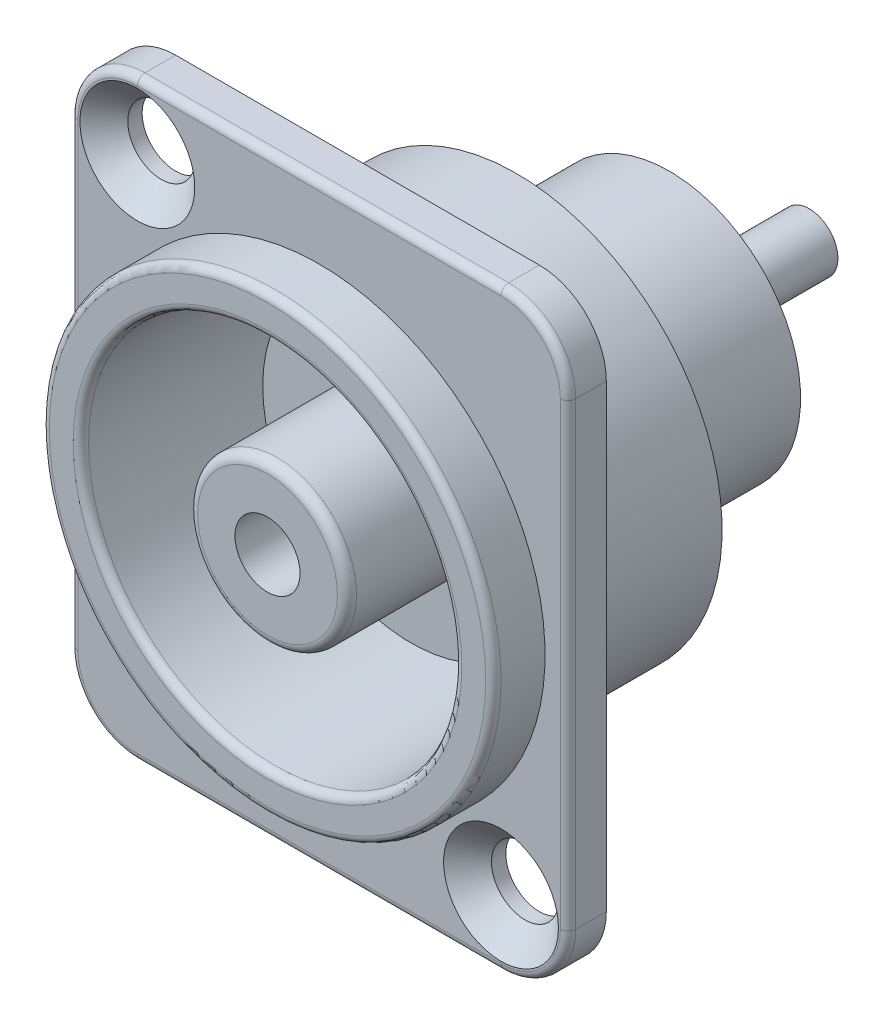
ISO-10303-21;
HEADER;
FILE_DESCRIPTION(('STEP AP214'),'2;1');
FILE_NAME('part.step','',(''),(''),'','','');
FILE_SCHEMA(('AUTOMOTIVE_DESIGN { 1 0 10303 214 1 1 1 1 }'));
ENDSEC;
DATA;
#1=APPLICATION_CONTEXT('core data for automotive mechanical design processes');
#2=APPLICATION_PROTOCOL_DEFINITION('international standard','automotive_design',2000,#1);
#3=PRODUCT_CONTEXT('',#1,'mechanical');
#4=PRODUCT('Part','Part','',(#3));
#5=PRODUCT_RELATED_PRODUCT_CATEGORY('part','',(#4));
#6=PRODUCT_DEFINITION_FORMATION('','',#4);
#7=PRODUCT_DEFINITION_CONTEXT('part definition',#1,'design');
#8=PRODUCT_DEFINITION('design','',#6,#7);
#9=PRODUCT_DEFINITION_SHAPE('','',#8);
#10=(LENGTH_UNIT() NAMED_UNIT(*) SI_UNIT(.MILLI.,.METRE.));
#11=(NAMED_UNIT(*) PLANE_ANGLE_UNIT() SI_UNIT($,.RADIAN.));
#12=(NAMED_UNIT(*) SI_UNIT($,.STERADIAN.) SOLID_ANGLE_UNIT());
#13=UNCERTAINTY_MEASURE_WITH_UNIT(LENGTH_MEASURE(1.E-05),#10,'distance_accuracy_value','');
#14=(GEOMETRIC_REPRESENTATION_CONTEXT(3) GLOBAL_UNCERTAINTY_ASSIGNED_CONTEXT((#13)) GLOBAL_UNIT_ASSIGNED_CONTEXT((#10,
#11,#12)) REPRESENTATION_CONTEXT('',''));
#15=CARTESIAN_POINT('',(0.,0.,0.));
#16=DIRECTION('',(0.,0.,1.));
#17=DIRECTION('',(1.,0.,0.));
#18=AXIS2_PLACEMENT_3D('',#15,#16,#17);
#19=CARTESIAN_POINT('',(0.,0.,2.));
#20=DIRECTION('',(0.,0.,-1.));
#21=DIRECTION('',(-1.,0.,0.));
#22=AXIS2_PLACEMENT_3D('',#19,#20,#21);
#23=PLANE('',#22);
#24=CARTESIAN_POINT('',(9.5,-12.,2.));
#25=DIRECTION('',(0.,0.,1.));
#26=DIRECTION('',(1.,0.,0.));
#27=AXIS2_PLACEMENT_3D('',#24,#25,#26);
#28=CIRCLE('',#27,2.99997515496501);
#29=CARTESIAN_POINT('',(12.499975154965,-12.,2.));
#30=VERTEX_POINT('',#29);
#31=EDGE_CURVE('E870',#30,#30,#28,.T.);
#32=ORIENTED_EDGE('',*,*,#31,.F.);
#33=EDGE_LOOP('',(#32));
#34=FACE_BOUND('',#33,.T.);
#35=CARTESIAN_POINT('',(0.,0.,2.));
#36=DIRECTION('',(0.,0.,-1.));
#37=DIRECTION('',(-1.,0.,0.));
#38=AXIS2_PLACEMENT_3D('',#35,#36,#37);
#39=CIRCLE('',#38,11.8);
#40=CARTESIAN_POINT('',(-11.8,0.,2.));
#41=VERTEX_POINT('',#40);
#42=EDGE_CURVE('E211',#41,#41,#39,.F.);
#43=ORIENTED_EDGE('',*,*,#42,.F.);
#44=EDGE_LOOP('',(#43));
#45=FACE_BOUND('',#44,.T.);
#46=CARTESIAN_POINT('',(9.5,12.,1.99999999999971));
#47=DIRECTION('',(0.,0.,-1.));
#48=DIRECTION('',(0.,1.,0.));
#49=AXIS2_PLACEMENT_3D('',#46,#47,#48);
#50=CIRCLE('',#49,3.09999951881);
#51=CARTESIAN_POINT('',(9.5,15.099999759405,1.99999999999993));
#52=VERTEX_POINT('',#51);
#53=CARTESIAN_POINT('',(12.599999903762,12.,1.99999999999994));
#54=VERTEX_POINT('',#53);
#55=EDGE_CURVE('E156',#52,#54,#50,.T.);
#56=ORIENTED_EDGE('',*,*,#55,.F.);
#57=DIRECTION('',(-1.,0.,0.));
#58=VECTOR('',#57,1.);
#59=CARTESIAN_POINT('',(0.,15.1,2.));
#60=LINE('',#59,#58);
#61=CARTESIAN_POINT('',(-9.5,15.099999903762,1.99999999999994));
#62=VERTEX_POINT('',#61);
#63=EDGE_CURVE('E199',#62,#52,#60,.F.);
#64=ORIENTED_EDGE('',*,*,#63,.F.);
#65=CARTESIAN_POINT('',(-9.5,12.,1.99999999999971));
#66=DIRECTION('',(0.,0.,-1.));
#67=DIRECTION('',(-1.,0.,0.));
#68=AXIS2_PLACEMENT_3D('',#65,#66,#67);
#69=CIRCLE('',#68,3.09999951881);
#70=CARTESIAN_POINT('',(-12.5999996992563,12.,1.99999999999991));
#71=VERTEX_POINT('',#70);
#72=EDGE_CURVE('E596',#71,#62,#69,.T.);
#73=ORIENTED_EDGE('',*,*,#72,.F.);
#74=DIRECTION('',(0.,-1.,0.));
#75=VECTOR('',#74,1.);
#76=CARTESIAN_POINT('',(-12.6,12.07591990335,2.));
#77=LINE('',#76,#75);
#78=CARTESIAN_POINT('',(-12.5999998797025,-11.99999999993,1.99999999999993));
#79=VERTEX_POINT('',#78);
#80=EDGE_CURVE('E601',#79,#71,#77,.F.);
#81=ORIENTED_EDGE('',*,*,#80,.F.);
#82=CARTESIAN_POINT('',(-9.5,-12.,1.99999999999971));
#83=DIRECTION('',(0.,0.,-1.));
#84=DIRECTION('',(0.,-1.,0.));
#85=AXIS2_PLACEMENT_3D('',#82,#83,#84);
#86=CIRCLE('',#85,3.09999951881);
#87=CARTESIAN_POINT('',(-9.5,-15.0999995789587,1.99999999999984));
#88=VERTEX_POINT('',#87);
#89=EDGE_CURVE('E637',#88,#79,#86,.T.);
#90=ORIENTED_EDGE('',*,*,#89,.F.);
#91=DIRECTION('',(1.,0.,0.));
#92=VECTOR('',#91,1.);
#93=CARTESIAN_POINT('',(-9.57591990335,-15.09999951881,1.99999999999971));
#94=LINE('',#93,#92);
#95=CARTESIAN_POINT('',(9.5,-15.09999951881,1.99999999999978));
#96=VERTEX_POINT('',#95);
#97=EDGE_CURVE('E661',#96,#88,#94,.F.);
#98=ORIENTED_EDGE('',*,*,#97,.F.);
#99=CARTESIAN_POINT('',(9.5,-12.,1.99999999999971));
#100=DIRECTION('',(0.,0.,-1.));
#101=DIRECTION('',(1.,0.,0.));
#102=AXIS2_PLACEMENT_3D('',#99,#100,#101);
#103=CIRCLE('',#102,3.09999951881);
#104=CARTESIAN_POINT('',(12.599999807524,-12.,1.99999999999994));
#105=VERTEX_POINT('',#104);
#106=EDGE_CURVE('E210',#105,#96,#103,.T.);
#107=ORIENTED_EDGE('',*,*,#106,.F.);
#108=DIRECTION('',(0.,1.,0.));
#109=VECTOR('',#108,1.);
#110=CARTESIAN_POINT('',(12.6,0.,2.));
#111=LINE('',#110,#109);
#112=EDGE_CURVE('E163',#54,#105,#111,.F.);
#113=ORIENTED_EDGE('',*,*,#112,.F.);
#114=EDGE_LOOP('',(#56,#64,#73,#81,#90,#98,#107,#113));
#115=FACE_BOUND('',#114,.T.);
#116=CARTESIAN_POINT('',(-9.5,12.,2.));
#117=DIRECTION('',(0.,0.,1.));
#118=DIRECTION('',(1.,0.,0.));
#119=AXIS2_PLACEMENT_3D('',#116,#117,#118);
#120=CIRCLE('',#119,2.99997515496501);
#121=CARTESIAN_POINT('',(-6.50002484503499,12.,2.));
#122=VERTEX_POINT('',#121);
#123=EDGE_CURVE('E866',#122,#122,#120,.T.);
#124=ORIENTED_EDGE('',*,*,#123,.F.);
#125=EDGE_LOOP('',(#124));
#126=FACE_BOUND('',#125,.T.);
#127=ADVANCED_FACE('F37',(#34,#45,#115,#126),#23,.F.);
#128=CARTESIAN_POINT('',(0.,0.,0.));
#129=DIRECTION('',(0.,0.,-1.));
#130=DIRECTION('',(-1.,0.,0.));
#131=AXIS2_PLACEMENT_3D('',#128,#129,#130);
#132=PLANE('',#131);
#133=CARTESIAN_POINT('',(0.,0.,0.));
#134=DIRECTION('',(0.,0.,-1.));
#135=DIRECTION('',(-1.,0.,0.));
#136=AXIS2_PLACEMENT_3D('',#133,#134,#135);
#137=CIRCLE('',#136,1.7);
#138=CARTESIAN_POINT('',(-1.7,0.,0.));
#139=VERTEX_POINT('',#138);
#140=EDGE_CURVE('E275',#139,#139,#137,.F.);
#141=ORIENTED_EDGE('',*,*,#140,.T.);
#142=EDGE_LOOP('',(#141));
#143=FACE_BOUND('',#142,.T.);
#144=ADVANCED_FACE('F39',(#143),#132,.F.);
#145=CARTESIAN_POINT('',(0.,0.,6.115));
#146=DIRECTION('',(0.,0.,-1.));
#147=DIRECTION('',(-1.,0.,0.));
#148=AXIS2_PLACEMENT_3D('',#145,#146,#147);
#149=CYLINDRICAL_SURFACE('',#148,1.7);
#150=ORIENTED_EDGE('',*,*,#140,.F.);
#151=EDGE_LOOP('',(#150));
#152=FACE_BOUND('',#151,.T.);
#153=CARTESIAN_POINT('',(0.,0.,4.7));
#154=DIRECTION('',(0.,0.,-1.));
#155=DIRECTION('',(-1.,0.,0.));
#156=AXIS2_PLACEMENT_3D('',#153,#154,#155);
#157=CIRCLE('',#156,1.7);
#158=CARTESIAN_POINT('',(-1.7,0.,4.7));
#159=VERTEX_POINT('',#158);
#160=EDGE_CURVE('E270',#159,#159,#157,.F.);
#161=ORIENTED_EDGE('',*,*,#160,.T.);
#162=EDGE_LOOP('',(#161));
#163=FACE_BOUND('',#162,.T.);
#164=ADVANCED_FACE('F495',(#152,#163),#149,.F.);
#165=CARTESIAN_POINT('',(0.,0.,4.7));
#166=DIRECTION('',(0.,0.,-1.));
#167=DIRECTION('',(-1.,0.,0.));
#168=AXIS2_PLACEMENT_3D('',#165,#166,#167);
#169=PLANE('',#168);
#170=ORIENTED_EDGE('',*,*,#160,.F.);
#171=EDGE_LOOP('',(#170));
#172=FACE_BOUND('',#171,.T.);
#173=CARTESIAN_POINT('',(0.,0.,4.7));
#174=DIRECTION('',(0.,0.,-1.));
#175=DIRECTION('',(0.,1.,0.));
#176=AXIS2_PLACEMENT_3D('',#173,#174,#175);
#177=CIRCLE('',#176,3.64999999999999);
#178=CARTESIAN_POINT('',(0.,3.65000000000001,4.7));
#179=VERTEX_POINT('',#178);
#180=CARTESIAN_POINT('',(0.,-3.64999999999999,4.7));
#181=VERTEX_POINT('',#180);
#182=EDGE_CURVE('E420',#179,#181,#177,.T.);
#183=ORIENTED_EDGE('',*,*,#182,.F.);
#184=CARTESIAN_POINT('',(0.,0.,4.7));
#185=DIRECTION('',(0.,0.,-1.));
#186=DIRECTION('',(0.,-1.,0.));
#187=AXIS2_PLACEMENT_3D('',#184,#185,#186);
#188=CIRCLE('',#187,3.65000000000001);
#189=EDGE_CURVE('E274',#181,#179,#188,.T.);
#190=ORIENTED_EDGE('',*,*,#189,.F.);
#191=EDGE_LOOP('',(#183,#190));
#192=FACE_BOUND('',#191,.T.);
#193=ADVANCED_FACE('F410',(#172,#192),#169,.F.);
#194=CARTESIAN_POINT('',(0.,0.,4.2));
#195=DIRECTION('',(0.,0.,-1.));
#196=DIRECTION('',(0.,1.,0.));
#197=AXIS2_PLACEMENT_3D('',#194,#195,#196);
#198=TOROIDAL_SURFACE('',#197,3.65,0.5);
#199=ORIENTED_EDGE('',*,*,#189,.T.);
#200=ORIENTED_EDGE('',*,*,#182,.T.);
#201=EDGE_LOOP('',(#199,#200));
#202=FACE_BOUND('',#201,.T.);
#203=CARTESIAN_POINT('',(0.,0.,4.2));
#204=DIRECTION('',(0.,0.,-1.));
#205=DIRECTION('',(-1.,0.,0.));
#206=AXIS2_PLACEMENT_3D('',#203,#204,#205);
#207=CIRCLE('',#206,4.15);
#208=CARTESIAN_POINT('',(-4.15,0.,4.2));
#209=VERTEX_POINT('',#208);
#210=EDGE_CURVE('E269',#209,#209,#207,.T.);
#211=ORIENTED_EDGE('',*,*,#210,.F.);
#212=EDGE_LOOP('',(#211));
#213=FACE_BOUND('',#212,.T.);
#214=ADVANCED_FACE('F398',(#202,#213),#198,.T.);
#215=CARTESIAN_POINT('',(0.,0.,6.115));
#216=DIRECTION('',(0.,0.,-1.));
#217=DIRECTION('',(-1.,0.,0.));
#218=AXIS2_PLACEMENT_3D('',#215,#216,#217);
#219=CYLINDRICAL_SURFACE('',#218,4.15);
#220=ORIENTED_EDGE('',*,*,#210,.T.);
#221=EDGE_LOOP('',(#220));
#222=FACE_BOUND('',#221,.T.);
#223=CARTESIAN_POINT('',(0.,0.,-2.8));
#224=DIRECTION('',(0.,0.,-1.));
#225=DIRECTION('',(-1.,0.,0.));
#226=AXIS2_PLACEMENT_3D('',#223,#224,#225);
#227=CIRCLE('',#226,4.15);
#228=CARTESIAN_POINT('',(-4.15,0.,-2.8));
#229=VERTEX_POINT('',#228);
#230=EDGE_CURVE('E265',#229,#229,#227,.F.);
#231=ORIENTED_EDGE('',*,*,#230,.T.);
#232=EDGE_LOOP('',(#231));
#233=FACE_BOUND('',#232,.T.);
#234=ADVANCED_FACE('F409',(#222,#233),#219,.T.);
#235=CARTESIAN_POINT('',(0.,0.,-21.6));
#236=DIRECTION('',(0.,0.,-1.));
#237=DIRECTION('',(-1.,0.,0.));
#238=AXIS2_PLACEMENT_3D('',#235,#236,#237);
#239=PLANE('',#238);
#240=CARTESIAN_POINT('',(0.,0.,-21.6));
#241=DIRECTION('',(0.,0.,-1.));
#242=DIRECTION('',(-1.,0.,0.));
#243=AXIS2_PLACEMENT_3D('',#240,#241,#242);
#244=CIRCLE('',#243,1.);
#245=CARTESIAN_POINT('',(-1.,0.,-21.6));
#246=VERTEX_POINT('',#245);
#247=EDGE_CURVE('E261',#246,#246,#244,.T.);
#248=ORIENTED_EDGE('',*,*,#247,.T.);
#249=EDGE_LOOP('',(#248));
#250=FACE_BOUND('',#249,.T.);
#251=ADVANCED_FACE('F766',(#250),#239,.T.);
#252=CARTESIAN_POINT('',(0.,0.,-2.8));
#253=DIRECTION('',(0.,0.,-1.));
#254=DIRECTION('',(-1.,0.,0.));
#255=AXIS2_PLACEMENT_3D('',#252,#253,#254);
#256=PLANE('',#255);
#257=ORIENTED_EDGE('',*,*,#230,.F.);
#258=EDGE_LOOP('',(#257));
#259=FACE_BOUND('',#258,.T.);
#260=CARTESIAN_POINT('',(0.,0.,-2.8));
#261=DIRECTION('',(0.,0.,-1.));
#262=DIRECTION('',(-1.,0.,0.));
#263=AXIS2_PLACEMENT_3D('',#260,#261,#262);
#264=CIRCLE('',#263,7.75);
#265=CARTESIAN_POINT('',(-7.75,0.,-2.8));
#266=VERTEX_POINT('',#265);
#267=EDGE_CURVE('E257',#266,#266,#264,.T.);
#268=ORIENTED_EDGE('',*,*,#267,.F.);
#269=EDGE_LOOP('',(#268));
#270=FACE_BOUND('',#269,.T.);
#271=ADVANCED_FACE('F763',(#259,#270),#256,.F.);
#272=CARTESIAN_POINT('',(0.,0.,6.115));
#273=DIRECTION('',(0.,0.,-1.));
#274=DIRECTION('',(-1.,0.,0.));
#275=AXIS2_PLACEMENT_3D('',#272,#273,#274);
#276=CYLINDRICAL_SURFACE('',#275,1.);
#277=ORIENTED_EDGE('',*,*,#247,.F.);
#278=EDGE_LOOP('',(#277));
#279=FACE_BOUND('',#278,.T.);
#280=CARTESIAN_POINT('',(0.,0.,-23.6));
#281=DIRECTION('',(0.,0.,-1.));
#282=DIRECTION('',(-1.,0.,0.));
#283=AXIS2_PLACEMENT_3D('',#280,#281,#282);
#284=CIRCLE('',#283,1.);
#285=CARTESIAN_POINT('',(-1.,0.,-23.6));
#286=VERTEX_POINT('',#285);
#287=EDGE_CURVE('E253',#286,#286,#284,.F.);
#288=ORIENTED_EDGE('',*,*,#287,.F.);
#289=EDGE_LOOP('',(#288));
#290=FACE_BOUND('',#289,.T.);
#291=ADVANCED_FACE('F759',(#279,#290),#276,.F.);
#292=CARTESIAN_POINT('',(0.,0.,6.115));
#293=DIRECTION('',(0.,0.,-1.));
#294=DIRECTION('',(-1.,0.,0.));
#295=AXIS2_PLACEMENT_3D('',#292,#293,#294);
#296=CYLINDRICAL_SURFACE('',#295,7.75);
#297=ORIENTED_EDGE('',*,*,#267,.T.);
#298=EDGE_LOOP('',(#297));
#299=FACE_BOUND('',#298,.T.);
#300=CARTESIAN_POINT('',(0.,0.,-5.8));
#301=DIRECTION('',(0.,0.,-1.));
#302=DIRECTION('',(-1.,0.,0.));
#303=AXIS2_PLACEMENT_3D('',#300,#301,#302);
#304=CIRCLE('',#303,7.75);
#305=CARTESIAN_POINT('',(-7.75,0.,-5.8));
#306=VERTEX_POINT('',#305);
#307=EDGE_CURVE('E249',#306,#306,#304,.F.);
#308=ORIENTED_EDGE('',*,*,#307,.T.);
#309=EDGE_LOOP('',(#308));
#310=FACE_BOUND('',#309,.T.);
#311=ADVANCED_FACE('F755',(#299,#310),#296,.T.);
#312=CARTESIAN_POINT('',(0.,0.,-23.6));
#313=DIRECTION('',(0.,0.,-1.));
#314=DIRECTION('',(-1.,0.,0.));
#315=AXIS2_PLACEMENT_3D('',#312,#313,#314);
#316=PLANE('',#315);
#317=ORIENTED_EDGE('',*,*,#287,.T.);
#318=EDGE_LOOP('',(#317));
#319=FACE_BOUND('',#318,.T.);
#320=CARTESIAN_POINT('',(0.,0.,-23.6));
#321=DIRECTION('',(0.,0.,-1.));
#322=DIRECTION('',(-1.,0.,0.));
#323=AXIS2_PLACEMENT_3D('',#320,#321,#322);
#324=CIRCLE('',#323,1.5);
#325=CARTESIAN_POINT('',(-1.5,0.,-23.6));
#326=VERTEX_POINT('',#325);
#327=EDGE_CURVE('E245',#326,#326,#324,.F.);
#328=ORIENTED_EDGE('',*,*,#327,.F.);
#329=EDGE_LOOP('',(#328));
#330=FACE_BOUND('',#329,.T.);
#331=ADVANCED_FACE('F749',(#319,#330),#316,.T.);
#332=CARTESIAN_POINT('',(0.,0.,-5.8));
#333=DIRECTION('',(0.,0.,-1.));
#334=DIRECTION('',(-1.,0.,0.));
#335=AXIS2_PLACEMENT_3D('',#332,#333,#334);
#336=PLANE('',#335);
#337=ORIENTED_EDGE('',*,*,#307,.F.);
#338=EDGE_LOOP('',(#337));
#339=FACE_BOUND('',#338,.T.);
#340=CARTESIAN_POINT('',(0.,0.,-5.8));
#341=DIRECTION('',(0.,0.,-1.));
#342=DIRECTION('',(-1.,0.,0.));
#343=AXIS2_PLACEMENT_3D('',#340,#341,#342);
#344=CIRCLE('',#343,9.75);
#345=CARTESIAN_POINT('',(-9.75,0.,-5.8));
#346=VERTEX_POINT('',#345);
#347=EDGE_CURVE('E241',#346,#346,#344,.F.);
#348=ORIENTED_EDGE('',*,*,#347,.T.);
#349=EDGE_LOOP('',(#348));
#350=FACE_BOUND('',#349,.T.);
#351=ADVANCED_FACE('F743',(#339,#350),#336,.F.);
#352=CARTESIAN_POINT('',(0.,0.,6.115));
#353=DIRECTION('',(0.,0.,-1.));
#354=DIRECTION('',(-1.,0.,0.));
#355=AXIS2_PLACEMENT_3D('',#352,#353,#354);
#356=CYLINDRICAL_SURFACE('',#355,1.5);
#357=ORIENTED_EDGE('',*,*,#327,.T.);
#358=EDGE_LOOP('',(#357));
#359=FACE_BOUND('',#358,.T.);
#360=CARTESIAN_POINT('',(0.,0.,-18.3));
#361=DIRECTION('',(0.,0.,-1.));
#362=DIRECTION('',(-1.,0.,0.));
#363=AXIS2_PLACEMENT_3D('',#360,#361,#362);
#364=CIRCLE('',#363,1.5);
#365=CARTESIAN_POINT('',(-1.5,0.,-18.3));
#366=VERTEX_POINT('',#365);
#367=EDGE_CURVE('E237',#366,#366,#364,.F.);
#368=ORIENTED_EDGE('',*,*,#367,.F.);
#369=EDGE_LOOP('',(#368));
#370=FACE_BOUND('',#369,.T.);
#371=ADVANCED_FACE('F738',(#359,#370),#356,.T.);
#372=CARTESIAN_POINT('',(0.,0.,6.115));
#373=DIRECTION('',(0.,0.,-1.));
#374=DIRECTION('',(-1.,0.,0.));
#375=AXIS2_PLACEMENT_3D('',#372,#373,#374);
#376=CYLINDRICAL_SURFACE('',#375,9.75);
#377=ORIENTED_EDGE('',*,*,#347,.F.);
#378=EDGE_LOOP('',(#377));
#379=FACE_BOUND('',#378,.T.);
#380=CARTESIAN_POINT('',(0.,0.,4.3));
#381=DIRECTION('',(0.,0.,-1.));
#382=DIRECTION('',(-0.00748700651881706,-0.999971971973908,0.));
#383=AXIS2_PLACEMENT_3D('',#380,#381,#382);
#384=CIRCLE('',#383,9.75);
#385=CARTESIAN_POINT('',(-0.0729983135584664,-9.7497267267456,4.3));
#386=VERTEX_POINT('',#385);
#387=EDGE_CURVE('E236',#386,#386,#384,.T.);
#388=ORIENTED_EDGE('',*,*,#387,.F.);
#389=EDGE_LOOP('',(#388));
#390=FACE_BOUND('',#389,.T.);
#391=ADVANCED_FACE('F733',(#379,#390),#376,.F.);
#392=CARTESIAN_POINT('',(0.,0.,-18.3));
#393=DIRECTION('',(0.,0.,-1.));
#394=DIRECTION('',(-1.,0.,0.));
#395=AXIS2_PLACEMENT_3D('',#392,#393,#394);
#396=PLANE('',#395);
#397=ORIENTED_EDGE('',*,*,#367,.T.);
#398=EDGE_LOOP('',(#397));
#399=FACE_BOUND('',#398,.T.);
#400=CARTESIAN_POINT('',(0.,0.,-18.3));
#401=DIRECTION('',(0.,0.,-1.));
#402=DIRECTION('',(-1.,0.,0.));
#403=AXIS2_PLACEMENT_3D('',#400,#401,#402);
#404=CIRCLE('',#403,4.);
#405=CARTESIAN_POINT('',(-4.,0.,-18.3));
#406=VERTEX_POINT('',#405);
#407=EDGE_CURVE('E231',#406,#406,#404,.F.);
#408=ORIENTED_EDGE('',*,*,#407,.F.);
#409=EDGE_LOOP('',(#408));
#410=FACE_BOUND('',#409,.T.);
#411=ADVANCED_FACE('F376',(#399,#410),#396,.T.);
#412=CARTESIAN_POINT('',(0.,0.,4.3));
#413=DIRECTION('',(0.,0.,-1.));
#414=DIRECTION('',(-0.00748700651881706,-0.999971971973909,0.));
#415=AXIS2_PLACEMENT_3D('',#412,#413,#414);
#416=TOROIDAL_SURFACE('',#415,10.15,0.4);
#417=CARTESIAN_POINT('',(0.,0.,4.69999999999999));
#418=DIRECTION('',(0.,0.,1.));
#419=DIRECTION('',(0.,1.,0.));
#420=AXIS2_PLACEMENT_3D('',#417,#418,#419);
#421=CIRCLE('',#420,10.14999993395);
#422=CARTESIAN_POINT('',(0.,10.149999953765,4.7));
#423=VERTEX_POINT('',#422);
#424=CARTESIAN_POINT('',(0.,-10.149999953765,4.7));
#425=VERTEX_POINT('',#424);
#426=EDGE_CURVE('E235',#423,#425,#421,.T.);
#427=ORIENTED_EDGE('',*,*,#426,.T.);
#428=CARTESIAN_POINT('',(0.,0.,4.7));
#429=DIRECTION('',(0.,0.,1.));
#430=DIRECTION('',(0.,-1.,0.));
#431=AXIS2_PLACEMENT_3D('',#428,#429,#430);
#432=CIRCLE('',#431,10.149999966975);
#433=EDGE_CURVE('E230',#425,#423,#432,.T.);
#434=ORIENTED_EDGE('',*,*,#433,.T.);
#435=EDGE_LOOP('',(#427,#434));
#436=FACE_BOUND('',#435,.T.);
#437=ORIENTED_EDGE('',*,*,#387,.T.);
#438=EDGE_LOOP('',(#437));
#439=FACE_BOUND('',#438,.T.);
#440=ADVANCED_FACE('F372',(#436,#439),#416,.T.);
#441=CARTESIAN_POINT('',(0.,0.,6.115));
#442=DIRECTION('',(0.,0.,-1.));
#443=DIRECTION('',(-1.,0.,0.));
#444=AXIS2_PLACEMENT_3D('',#441,#442,#443);
#445=CYLINDRICAL_SURFACE('',#444,4.);
#446=ORIENTED_EDGE('',*,*,#407,.T.);
#447=EDGE_LOOP('',(#446));
#448=FACE_BOUND('',#447,.T.);
#449=CARTESIAN_POINT('',(0.,0.,-16.3));
#450=DIRECTION('',(0.,0.,-1.));
#451=DIRECTION('',(-1.,0.,0.));
#452=AXIS2_PLACEMENT_3D('',#449,#450,#451);
#453=CIRCLE('',#452,4.);
#454=CARTESIAN_POINT('',(-4.,0.,-16.3));
#455=VERTEX_POINT('',#454);
#456=EDGE_CURVE('E225',#455,#455,#453,.F.);
#457=ORIENTED_EDGE('',*,*,#456,.F.);
#458=EDGE_LOOP('',(#457));
#459=FACE_BOUND('',#458,.T.);
#460=ADVANCED_FACE('F332',(#448,#459),#445,.T.);
#461=CARTESIAN_POINT('',(0.,0.,4.7));
#462=DIRECTION('',(0.,0.,-1.));
#463=DIRECTION('',(-1.,0.,0.));
#464=AXIS2_PLACEMENT_3D('',#461,#462,#463);
#465=PLANE('',#464);
#466=ORIENTED_EDGE('',*,*,#426,.F.);
#467=ORIENTED_EDGE('',*,*,#433,.F.);
#468=EDGE_LOOP('',(#466,#467));
#469=FACE_BOUND('',#468,.T.);
#470=CARTESIAN_POINT('',(0.,0.,4.69999999999999));
#471=DIRECTION('',(0.,0.,-1.));
#472=DIRECTION('',(0.,-1.,0.));
#473=AXIS2_PLACEMENT_3D('',#470,#471,#472);
#474=CIRCLE('',#473,11.39999990816);
#475=CARTESIAN_POINT('',(0.,-11.399999926528,4.7));
#476=VERTEX_POINT('',#475);
#477=CARTESIAN_POINT('',(0.,11.399999926528,4.7));
#478=VERTEX_POINT('',#477);
#479=EDGE_CURVE('E229',#476,#478,#474,.T.);
#480=ORIENTED_EDGE('',*,*,#479,.F.);
#481=CARTESIAN_POINT('',(0.,0.,4.7));
#482=DIRECTION('',(0.,0.,-1.));
#483=DIRECTION('',(0.,1.,0.));
#484=AXIS2_PLACEMENT_3D('',#481,#482,#483);
#485=CIRCLE('',#484,11.39999995408);
#486=EDGE_CURVE('E224',#478,#476,#485,.T.);
#487=ORIENTED_EDGE('',*,*,#486,.F.);
#488=EDGE_LOOP('',(#480,#487));
#489=FACE_BOUND('',#488,.T.);
#490=ADVANCED_FACE('F323',(#469,#489),#465,.F.);
#491=CARTESIAN_POINT('',(0.,0.,-16.3));
#492=DIRECTION('',(0.,0.,-1.));
#493=DIRECTION('',(-1.,0.,0.));
#494=AXIS2_PLACEMENT_3D('',#491,#492,#493);
#495=PLANE('',#494);
#496=ORIENTED_EDGE('',*,*,#456,.T.);
#497=EDGE_LOOP('',(#496));
#498=FACE_BOUND('',#497,.T.);
#499=CARTESIAN_POINT('',(0.,0.,-16.3));
#500=DIRECTION('',(0.,0.,-1.));
#501=DIRECTION('',(-1.,0.,0.));
#502=AXIS2_PLACEMENT_3D('',#499,#500,#501);
#503=CIRCLE('',#502,6.85);
#504=CARTESIAN_POINT('',(-6.85,0.,-16.3));
#505=VERTEX_POINT('',#504);
#506=EDGE_CURVE('E220',#505,#505,#503,.F.);
#507=ORIENTED_EDGE('',*,*,#506,.F.);
#508=EDGE_LOOP('',(#507));
#509=FACE_BOUND('',#508,.T.);
#510=ADVANCED_FACE('F301',(#498,#509),#495,.T.);
#511=CARTESIAN_POINT('',(0.,0.,4.3));
#512=DIRECTION('',(0.,0.,-1.));
#513=DIRECTION('',(-0.00913957165822119,-0.999958233242721,0.));
#514=AXIS2_PLACEMENT_3D('',#511,#512,#513);
#515=TOROIDAL_SURFACE('',#514,11.4,0.4);
#516=CARTESIAN_POINT('',(0.,0.,4.3));
#517=DIRECTION('',(0.,0.,-1.));
#518=DIRECTION('',(-1.,0.,0.));
#519=AXIS2_PLACEMENT_3D('',#516,#517,#518);
#520=CIRCLE('',#519,11.8);
#521=CARTESIAN_POINT('',(-11.8,0.,4.3));
#522=VERTEX_POINT('',#521);
#523=EDGE_CURVE('E219',#522,#522,#520,.T.);
#524=ORIENTED_EDGE('',*,*,#523,.F.);
#525=EDGE_LOOP('',(#524));
#526=FACE_BOUND('',#525,.T.);
#527=ORIENTED_EDGE('',*,*,#486,.T.);
#528=ORIENTED_EDGE('',*,*,#479,.T.);
#529=EDGE_LOOP('',(#527,#528));
#530=FACE_BOUND('',#529,.T.);
#531=ADVANCED_FACE('F289',(#526,#530),#515,.T.);
#532=CARTESIAN_POINT('',(0.,0.,6.115));
#533=DIRECTION('',(0.,0.,-1.));
#534=DIRECTION('',(-1.,0.,0.));
#535=AXIS2_PLACEMENT_3D('',#532,#533,#534);
#536=CYLINDRICAL_SURFACE('',#535,6.85);
#537=ORIENTED_EDGE('',*,*,#506,.T.);
#538=EDGE_LOOP('',(#537));
#539=FACE_BOUND('',#538,.T.);
#540=CARTESIAN_POINT('',(0.,0.,-9.3));
#541=DIRECTION('',(0.,0.,-1.));
#542=DIRECTION('',(-1.,0.,0.));
#543=AXIS2_PLACEMENT_3D('',#540,#541,#542);
#544=CIRCLE('',#543,6.85);
#545=CARTESIAN_POINT('',(-6.85,0.,-9.3));
#546=VERTEX_POINT('',#545);
#547=EDGE_CURVE('E215',#546,#546,#544,.F.);
#548=ORIENTED_EDGE('',*,*,#547,.F.);
#549=EDGE_LOOP('',(#548));
#550=FACE_BOUND('',#549,.T.);
#551=ADVANCED_FACE('F300',(#539,#550),#536,.T.);
#552=CARTESIAN_POINT('',(0.,0.,6.115));
#553=DIRECTION('',(0.,0.,-1.));
#554=DIRECTION('',(-1.,0.,0.));
#555=AXIS2_PLACEMENT_3D('',#552,#553,#554);
#556=CYLINDRICAL_SURFACE('',#555,11.8);
#557=ORIENTED_EDGE('',*,*,#42,.T.);
#558=EDGE_LOOP('',(#557));
#559=FACE_BOUND('',#558,.T.);
#560=ORIENTED_EDGE('',*,*,#523,.T.);
#561=EDGE_LOOP('',(#560));
#562=FACE_BOUND('',#561,.T.);
#563=ADVANCED_FACE('F702',(#559,#562),#556,.T.);
#564=CARTESIAN_POINT('',(0.,0.,-9.3));
#565=DIRECTION('',(0.,0.,-1.));
#566=DIRECTION('',(-1.,0.,0.));
#567=AXIS2_PLACEMENT_3D('',#564,#565,#566);
#568=PLANE('',#567);
#569=ORIENTED_EDGE('',*,*,#547,.T.);
#570=EDGE_LOOP('',(#569));
#571=FACE_BOUND('',#570,.T.);
#572=CARTESIAN_POINT('',(0.,0.,-9.3));
#573=DIRECTION('',(0.,0.,-1.));
#574=DIRECTION('',(-1.,0.,0.));
#575=AXIS2_PLACEMENT_3D('',#572,#573,#574);
#576=CIRCLE('',#575,7.75);
#577=CARTESIAN_POINT('',(-7.75,0.,-9.3));
#578=VERTEX_POINT('',#577);
#579=EDGE_CURVE('E206',#578,#578,#576,.F.);
#580=ORIENTED_EDGE('',*,*,#579,.F.);
#581=EDGE_LOOP('',(#580));
#582=FACE_BOUND('',#581,.T.);
#583=ADVANCED_FACE('F697',(#571,#582),#568,.T.);
#584=CARTESIAN_POINT('',(0.,0.,6.115));
#585=DIRECTION('',(0.,0.,-1.));
#586=DIRECTION('',(-1.,0.,0.));
#587=AXIS2_PLACEMENT_3D('',#584,#585,#586);
#588=CYLINDRICAL_SURFACE('',#587,7.75);
#589=ORIENTED_EDGE('',*,*,#579,.T.);
#590=EDGE_LOOP('',(#589));
#591=FACE_BOUND('',#590,.T.);
#592=CARTESIAN_POINT('',(0.,0.,-8.3));
#593=DIRECTION('',(0.,0.,-1.));
#594=DIRECTION('',(-1.,0.,0.));
#595=AXIS2_PLACEMENT_3D('',#592,#593,#594);
#596=CIRCLE('',#595,7.75);
#597=CARTESIAN_POINT('',(-7.75,0.,-8.3));
#598=VERTEX_POINT('',#597);
#599=EDGE_CURVE('E191',#598,#598,#596,.F.);
#600=ORIENTED_EDGE('',*,*,#599,.F.);
#601=EDGE_LOOP('',(#600));
#602=FACE_BOUND('',#601,.T.);
#603=ADVANCED_FACE('F695',(#591,#602),#588,.T.);
#604=CARTESIAN_POINT('',(9.5,-12.,1.6));
#605=DIRECTION('',(0.,0.,1.));
#606=DIRECTION('',(-0.021689699968861,-0.999764750786534,0.));
#607=AXIS2_PLACEMENT_3D('',#604,#605,#606);
#608=TOROIDAL_SURFACE('',#607,3.1,0.4);
#609=CARTESIAN_POINT('',(12.6,-12.,1.6));
#610=DIRECTION('',(0.,1.,0.));
#611=DIRECTION('',(0.,0.,1.));
#612=AXIS2_PLACEMENT_3D('',#609,#610,#611);
#613=CIRCLE('',#612,0.4);
#614=CARTESIAN_POINT('',(13.,-12.,1.6));
#615=VERTEX_POINT('',#614);
#616=EDGE_CURVE('E164',#105,#615,#613,.T.);
#617=ORIENTED_EDGE('',*,*,#616,.F.);
#618=ORIENTED_EDGE('',*,*,#106,.T.);
#619=CARTESIAN_POINT('',(9.5,-15.1,1.6));
#620=DIRECTION('',(1.,0.,0.));
#621=DIRECTION('',(0.,0.,-1.));
#622=AXIS2_PLACEMENT_3D('',#619,#620,#621);
#623=CIRCLE('',#622,0.4);
#624=CARTESIAN_POINT('',(9.5,-15.5,1.6));
#625=VERTEX_POINT('',#624);
#626=EDGE_CURVE('E669',#625,#96,#623,.F.);
#627=ORIENTED_EDGE('',*,*,#626,.F.);
#628=CARTESIAN_POINT('',(9.5,-12.,1.6));
#629=DIRECTION('',(0.,0.,1.));
#630=DIRECTION('',(1.,0.,0.));
#631=AXIS2_PLACEMENT_3D('',#628,#629,#630);
#632=CIRCLE('',#631,3.5);
#633=EDGE_CURVE('E144',#615,#625,#632,.F.);
#634=ORIENTED_EDGE('',*,*,#633,.F.);
#635=EDGE_LOOP('',(#617,#618,#627,#634));
#636=FACE_BOUND('',#635,.T.);
#637=ADVANCED_FACE('F672',(#636),#608,.T.);
#638=CARTESIAN_POINT('',(-9.57591990335,-15.1,1.6));
#639=DIRECTION('',(1.,0.,0.));
#640=DIRECTION('',(0.,0.,-1.));
#641=AXIS2_PLACEMENT_3D('',#638,#639,#640);
#642=CYLINDRICAL_SURFACE('',#641,0.4);
#643=ORIENTED_EDGE('',*,*,#626,.T.);
#644=ORIENTED_EDGE('',*,*,#97,.T.);
#645=CARTESIAN_POINT('',(-9.5,-15.1,1.6));
#646=DIRECTION('',(1.,0.,0.));
#647=DIRECTION('',(0.,-1.,0.));
#648=AXIS2_PLACEMENT_3D('',#645,#646,#647);
#649=CIRCLE('',#648,0.4);
#650=CARTESIAN_POINT('',(-9.5,-15.5,1.6));
#651=VERTEX_POINT('',#650);
#652=EDGE_CURVE('E648',#651,#88,#649,.F.);
#653=ORIENTED_EDGE('',*,*,#652,.F.);
#654=DIRECTION('',(1.,0.,0.));
#655=VECTOR('',#654,1.);
#656=CARTESIAN_POINT('',(-9.5,-15.5,1.6));
#657=LINE('',#656,#655);
#658=EDGE_CURVE('E547',#625,#651,#657,.F.);
#659=ORIENTED_EDGE('',*,*,#658,.F.);
#660=EDGE_LOOP('',(#643,#644,#653,#659));
#661=FACE_BOUND('',#660,.T.);
#662=ADVANCED_FACE('F654',(#661),#642,.T.);
#663=CARTESIAN_POINT('',(-9.5,-12.,1.6));
#664=DIRECTION('',(0.,0.,1.));
#665=DIRECTION('',(-0.999764750786534,0.021689699968861,0.));
#666=AXIS2_PLACEMENT_3D('',#663,#664,#665);
#667=TOROIDAL_SURFACE('',#666,3.1,0.4);
#668=ORIENTED_EDGE('',*,*,#652,.T.);
#669=ORIENTED_EDGE('',*,*,#89,.T.);
#670=CARTESIAN_POINT('',(-12.6,-11.99999999986,1.6));
#671=DIRECTION('',(0.,-1.,0.));
#672=DIRECTION('',(0.,0.,-1.));
#673=AXIS2_PLACEMENT_3D('',#670,#671,#672);
#674=CIRCLE('',#673,0.4);
#675=CARTESIAN_POINT('',(-13.,-11.99999999993,1.6));
#676=VERTEX_POINT('',#675);
#677=EDGE_CURVE('E633',#676,#79,#674,.F.);
#678=ORIENTED_EDGE('',*,*,#677,.F.);
#679=CARTESIAN_POINT('',(-9.5,-12.,1.6));
#680=DIRECTION('',(0.,0.,1.));
#681=DIRECTION('',(1.,0.,0.));
#682=AXIS2_PLACEMENT_3D('',#679,#680,#681);
#683=CIRCLE('',#682,3.5);
#684=EDGE_CURVE('E640',#651,#676,#683,.F.);
#685=ORIENTED_EDGE('',*,*,#684,.F.);
#686=EDGE_LOOP('',(#668,#669,#678,#685));
#687=FACE_BOUND('',#686,.T.);
#688=ADVANCED_FACE('F650',(#687),#667,.T.);
#689=CARTESIAN_POINT('',(-12.6,12.07591990335,1.6));
#690=DIRECTION('',(0.,-1.,0.));
#691=DIRECTION('',(0.,0.,-1.));
#692=AXIS2_PLACEMENT_3D('',#689,#690,#691);
#693=CYLINDRICAL_SURFACE('',#692,0.4);
#694=ORIENTED_EDGE('',*,*,#677,.T.);
#695=ORIENTED_EDGE('',*,*,#80,.T.);
#696=CARTESIAN_POINT('',(-12.6,12.,1.6));
#697=DIRECTION('',(0.,-1.,0.));
#698=DIRECTION('',(-1.,0.,0.));
#699=AXIS2_PLACEMENT_3D('',#696,#697,#698);
#700=CIRCLE('',#699,0.4);
#701=CARTESIAN_POINT('',(-13.,12.,1.6));
#702=VERTEX_POINT('',#701);
#703=EDGE_CURVE('E620',#702,#71,#700,.F.);
#704=ORIENTED_EDGE('',*,*,#703,.F.);
#705=DIRECTION('',(0.,1.,0.));
#706=VECTOR('',#705,1.);
#707=CARTESIAN_POINT('',(-13.,12.,1.6));
#708=LINE('',#707,#706);
#709=EDGE_CURVE('E625',#676,#702,#708,.T.);
#710=ORIENTED_EDGE('',*,*,#709,.F.);
#711=EDGE_LOOP('',(#694,#695,#704,#710));
#712=FACE_BOUND('',#711,.T.);
#713=ADVANCED_FACE('F613',(#712),#693,.T.);
#714=CARTESIAN_POINT('',(-9.5,12.,1.6));
#715=DIRECTION('',(0.,0.,1.));
#716=DIRECTION('',(0.021689699968861,0.999764750786534,0.));
#717=AXIS2_PLACEMENT_3D('',#714,#715,#716);
#718=TOROIDAL_SURFACE('',#717,3.1,0.4);
#719=ORIENTED_EDGE('',*,*,#703,.T.);
#720=ORIENTED_EDGE('',*,*,#72,.T.);
#721=CARTESIAN_POINT('',(-9.499999999862,15.1,1.6));
#722=DIRECTION('',(-1.,0.,0.));
#723=DIRECTION('',(0.,0.,1.));
#724=AXIS2_PLACEMENT_3D('',#721,#722,#723);
#725=CIRCLE('',#724,0.4);
#726=CARTESIAN_POINT('',(-9.499999999931,15.5,1.6));
#727=VERTEX_POINT('',#726);
#728=EDGE_CURVE('E203',#727,#62,#725,.F.);
#729=ORIENTED_EDGE('',*,*,#728,.F.);
#730=CARTESIAN_POINT('',(-9.5,12.,1.6));
#731=DIRECTION('',(0.,0.,1.));
#732=DIRECTION('',(1.,0.,0.));
#733=AXIS2_PLACEMENT_3D('',#730,#731,#732);
#734=CIRCLE('',#733,3.5);
#735=EDGE_CURVE('E897',#702,#727,#734,.F.);
#736=ORIENTED_EDGE('',*,*,#735,.F.);
#737=EDGE_LOOP('',(#719,#720,#729,#736));
#738=FACE_BOUND('',#737,.T.);
#739=ADVANCED_FACE('F603',(#738),#718,.T.);
#740=CARTESIAN_POINT('',(9.57591990335,15.1,1.6));
#741=DIRECTION('',(-1.,0.,0.));
#742=DIRECTION('',(0.,0.,1.));
#743=AXIS2_PLACEMENT_3D('',#740,#741,#742);
#744=CYLINDRICAL_SURFACE('',#743,0.4);
#745=ORIENTED_EDGE('',*,*,#728,.T.);
#746=ORIENTED_EDGE('',*,*,#63,.T.);
#747=CARTESIAN_POINT('',(9.5,15.1,1.6));
#748=DIRECTION('',(-1.,0.,0.));
#749=DIRECTION('',(0.,1.,0.));
#750=AXIS2_PLACEMENT_3D('',#747,#748,#749);
#751=CIRCLE('',#750,0.4);
#752=CARTESIAN_POINT('',(9.5,15.5,1.6));
#753=VERTEX_POINT('',#752);
#754=EDGE_CURVE('E202',#753,#52,#751,.F.);
#755=ORIENTED_EDGE('',*,*,#754,.F.);
#756=DIRECTION('',(1.,0.,0.));
#757=VECTOR('',#756,1.);
#758=CARTESIAN_POINT('',(9.5,15.5,1.6));
#759=LINE('',#758,#757);
#760=EDGE_CURVE('E890',#727,#753,#759,.T.);
#761=ORIENTED_EDGE('',*,*,#760,.F.);
#762=EDGE_LOOP('',(#745,#746,#755,#761));
#763=FACE_BOUND('',#762,.T.);
#764=ADVANCED_FACE('F580',(#763),#744,.T.);
#765=CARTESIAN_POINT('',(9.5,12.,1.6));
#766=DIRECTION('',(0.,0.,1.));
#767=DIRECTION('',(0.999764750786534,-0.021689699968861,0.));
#768=AXIS2_PLACEMENT_3D('',#765,#766,#767);
#769=TOROIDAL_SURFACE('',#768,3.1,0.4);
#770=ORIENTED_EDGE('',*,*,#754,.T.);
#771=ORIENTED_EDGE('',*,*,#55,.T.);
#772=CARTESIAN_POINT('',(12.6,11.99999999986,1.6));
#773=DIRECTION('',(0.,1.,0.));
#774=DIRECTION('',(0.,0.,1.));
#775=AXIS2_PLACEMENT_3D('',#772,#773,#774);
#776=CIRCLE('',#775,0.4);
#777=CARTESIAN_POINT('',(13.,11.99999999993,1.6));
#778=VERTEX_POINT('',#777);
#779=EDGE_CURVE('E150',#778,#54,#776,.F.);
#780=ORIENTED_EDGE('',*,*,#779,.F.);
#781=CARTESIAN_POINT('',(9.5,12.,1.6));
#782=DIRECTION('',(0.,0.,1.));
#783=DIRECTION('',(1.,0.,0.));
#784=AXIS2_PLACEMENT_3D('',#781,#782,#783);
#785=CIRCLE('',#784,3.5);
#786=EDGE_CURVE('E153',#753,#778,#785,.F.);
#787=ORIENTED_EDGE('',*,*,#786,.F.);
#788=EDGE_LOOP('',(#770,#771,#780,#787));
#789=FACE_BOUND('',#788,.T.);
#790=ADVANCED_FACE('F152',(#789),#769,.T.);
#791=CARTESIAN_POINT('',(12.6,-12.07591990335,1.6));
#792=DIRECTION('',(0.,1.,0.));
#793=DIRECTION('',(0.,0.,1.));
#794=AXIS2_PLACEMENT_3D('',#791,#792,#793);
#795=CYLINDRICAL_SURFACE('',#794,0.4);
#796=ORIENTED_EDGE('',*,*,#779,.T.);
#797=ORIENTED_EDGE('',*,*,#112,.T.);
#798=ORIENTED_EDGE('',*,*,#616,.T.);
#799=DIRECTION('',(0.,1.,0.));
#800=VECTOR('',#799,1.);
#801=CARTESIAN_POINT('',(13.,-12.,1.6));
#802=LINE('',#801,#800);
#803=EDGE_CURVE('E173',#778,#615,#802,.F.);
#804=ORIENTED_EDGE('',*,*,#803,.F.);
#805=EDGE_LOOP('',(#796,#797,#798,#804));
#806=FACE_BOUND('',#805,.T.);
#807=ADVANCED_FACE('F174',(#806),#795,.T.);
#808=CARTESIAN_POINT('',(0.,0.,-8.3));
#809=DIRECTION('',(0.,0.,-1.));
#810=DIRECTION('',(-1.,0.,0.));
#811=AXIS2_PLACEMENT_3D('',#808,#809,#810);
#812=PLANE('',#811);
#813=ORIENTED_EDGE('',*,*,#599,.T.);
#814=EDGE_LOOP('',(#813));
#815=FACE_BOUND('',#814,.T.);
#816=CARTESIAN_POINT('',(0.,0.,-8.3));
#817=DIRECTION('',(0.,0.,-1.));
#818=DIRECTION('',(-1.,0.,0.));
#819=AXIS2_PLACEMENT_3D('',#816,#817,#818);
#820=CIRCLE('',#819,10.75);
#821=CARTESIAN_POINT('',(-10.75,0.,-8.3));
#822=VERTEX_POINT('',#821);
#823=EDGE_CURVE('E178',#822,#822,#820,.F.);
#824=ORIENTED_EDGE('',*,*,#823,.F.);
#825=EDGE_LOOP('',(#824));
#826=FACE_BOUND('',#825,.T.);
#827=ADVANCED_FACE('F475',(#815,#826),#812,.T.);
#828=CARTESIAN_POINT('',(9.5,-12.,2.));
#829=DIRECTION('',(0.,0.,1.));
#830=DIRECTION('',(1.,0.,0.));
#831=AXIS2_PLACEMENT_3D('',#828,#829,#830);
#832=CYLINDRICAL_SURFACE('',#831,3.5);
#833=DIRECTION('',(0.,0.,-1.));
#834=VECTOR('',#833,1.);
#835=CARTESIAN_POINT('',(13.,-12.,2.));
#836=LINE('',#835,#834);
#837=CARTESIAN_POINT('',(13.,-12.,0.));
#838=VERTEX_POINT('',#837);
#839=EDGE_CURVE('E169',#615,#838,#836,.T.);
#840=ORIENTED_EDGE('',*,*,#839,.F.);
#841=ORIENTED_EDGE('',*,*,#633,.T.);
#842=DIRECTION('',(0.,0.,-1.));
#843=VECTOR('',#842,1.);
#844=CARTESIAN_POINT('',(9.5,-15.5,2.));
#845=LINE('',#844,#843);
#846=CARTESIAN_POINT('',(9.5,-15.5,0.));
#847=VERTEX_POINT('',#846);
#848=EDGE_CURVE('E545',#847,#625,#845,.F.);
#849=ORIENTED_EDGE('',*,*,#848,.F.);
#850=CARTESIAN_POINT('',(9.5,-12.,0.));
#851=DIRECTION('',(0.,0.,1.));
#852=DIRECTION('',(1.,0.,0.));
#853=AXIS2_PLACEMENT_3D('',#850,#851,#852);
#854=CIRCLE('',#853,3.5);
#855=EDGE_CURVE('E459',#838,#847,#854,.F.);
#856=ORIENTED_EDGE('',*,*,#855,.F.);
#857=EDGE_LOOP('',(#840,#841,#849,#856));
#858=FACE_BOUND('',#857,.T.);
#859=ADVANCED_FACE('F477',(#858),#832,.T.);
#860=CARTESIAN_POINT('',(-9.5,-15.5,2.));
#861=DIRECTION('',(0.,-1.,0.));
#862=DIRECTION('',(0.,0.,-1.));
#863=AXIS2_PLACEMENT_3D('',#860,#861,#862);
#864=PLANE('',#863);
#865=ORIENTED_EDGE('',*,*,#848,.T.);
#866=ORIENTED_EDGE('',*,*,#658,.T.);
#867=DIRECTION('',(0.,0.,1.));
#868=VECTOR('',#867,1.);
#869=CARTESIAN_POINT('',(-9.5,-15.5,2.));
#870=LINE('',#869,#868);
#871=CARTESIAN_POINT('',(-9.5,-15.5,0.));
#872=VERTEX_POINT('',#871);
#873=EDGE_CURVE('E554',#872,#651,#870,.T.);
#874=ORIENTED_EDGE('',*,*,#873,.F.);
#875=DIRECTION('',(-1.,0.,0.));
#876=VECTOR('',#875,1.);
#877=CARTESIAN_POINT('',(0.,-15.5,0.));
#878=LINE('',#877,#876);
#879=EDGE_CURVE('E458',#847,#872,#878,.T.);
#880=ORIENTED_EDGE('',*,*,#879,.F.);
#881=EDGE_LOOP('',(#865,#866,#874,#880));
#882=FACE_BOUND('',#881,.T.);
#883=ADVANCED_FACE('F484',(#882),#864,.T.);
#884=CARTESIAN_POINT('',(-9.5,-12.,2.));
#885=DIRECTION('',(0.,0.,1.));
#886=DIRECTION('',(1.,0.,0.));
#887=AXIS2_PLACEMENT_3D('',#884,#885,#886);
#888=CYLINDRICAL_SURFACE('',#887,3.5);
#889=ORIENTED_EDGE('',*,*,#873,.T.);
#890=ORIENTED_EDGE('',*,*,#684,.T.);
#891=DIRECTION('',(0.,0.,1.));
#892=VECTOR('',#891,1.);
#893=CARTESIAN_POINT('',(-13.,-12.,2.));
#894=LINE('',#893,#892);
#895=CARTESIAN_POINT('',(-13.,-12.,0.));
#896=VERTEX_POINT('',#895);
#897=EDGE_CURVE('E630',#896,#676,#894,.T.);
#898=ORIENTED_EDGE('',*,*,#897,.F.);
#899=CARTESIAN_POINT('',(-9.5,-12.,0.));
#900=DIRECTION('',(0.,0.,1.));
#901=DIRECTION('',(1.,0.,0.));
#902=AXIS2_PLACEMENT_3D('',#899,#900,#901);
#903=CIRCLE('',#902,3.5);
#904=EDGE_CURVE('E455',#872,#896,#903,.F.);
#905=ORIENTED_EDGE('',*,*,#904,.F.);
#906=EDGE_LOOP('',(#889,#890,#898,#905));
#907=FACE_BOUND('',#906,.T.);
#908=ADVANCED_FACE('F533',(#907),#888,.T.);
#909=CARTESIAN_POINT('',(-13.,12.,2.));
#910=DIRECTION('',(-1.,0.,0.));
#911=DIRECTION('',(0.,0.,1.));
#912=AXIS2_PLACEMENT_3D('',#909,#910,#911);
#913=PLANE('',#912);
#914=ORIENTED_EDGE('',*,*,#897,.T.);
#915=ORIENTED_EDGE('',*,*,#709,.T.);
#916=DIRECTION('',(0.,0.,1.));
#917=VECTOR('',#916,1.);
#918=CARTESIAN_POINT('',(-13.,12.,2.));
#919=LINE('',#918,#917);
#920=CARTESIAN_POINT('',(-13.,12.,0.));
#921=VERTEX_POINT('',#920);
#922=EDGE_CURVE('E629',#921,#702,#919,.T.);
#923=ORIENTED_EDGE('',*,*,#922,.F.);
#924=DIRECTION('',(0.,1.,0.));
#925=VECTOR('',#924,1.);
#926=CARTESIAN_POINT('',(-13.,0.,0.));
#927=LINE('',#926,#925);
#928=EDGE_CURVE('E454',#896,#921,#927,.T.);
#929=ORIENTED_EDGE('',*,*,#928,.F.);
#930=EDGE_LOOP('',(#914,#915,#923,#929));
#931=FACE_BOUND('',#930,.T.);
#932=ADVANCED_FACE('F529',(#931),#913,.T.);
#933=CARTESIAN_POINT('',(-9.5,12.,2.));
#934=DIRECTION('',(0.,0.,1.));
#935=DIRECTION('',(1.,0.,0.));
#936=AXIS2_PLACEMENT_3D('',#933,#934,#935);
#937=CYLINDRICAL_SURFACE('',#936,3.5);
#938=ORIENTED_EDGE('',*,*,#922,.T.);
#939=ORIENTED_EDGE('',*,*,#735,.T.);
#940=DIRECTION('',(0.,0.,1.));
#941=VECTOR('',#940,1.);
#942=CARTESIAN_POINT('',(-9.5,15.5,2.));
#943=LINE('',#942,#941);
#944=CARTESIAN_POINT('',(-9.5,15.5,0.));
#945=VERTEX_POINT('',#944);
#946=EDGE_CURVE('E893',#945,#727,#943,.T.);
#947=ORIENTED_EDGE('',*,*,#946,.F.);
#948=CARTESIAN_POINT('',(-9.5,12.,0.));
#949=DIRECTION('',(0.,0.,1.));
#950=DIRECTION('',(1.,0.,0.));
#951=AXIS2_PLACEMENT_3D('',#948,#949,#950);
#952=CIRCLE('',#951,3.5);
#953=EDGE_CURVE('E450',#921,#945,#952,.F.);
#954=ORIENTED_EDGE('',*,*,#953,.F.);
#955=EDGE_LOOP('',(#938,#939,#947,#954));
#956=FACE_BOUND('',#955,.T.);
#957=ADVANCED_FACE('F525',(#956),#937,.T.);
#958=CARTESIAN_POINT('',(9.5,15.5,2.));
#959=DIRECTION('',(0.,1.,0.));
#960=DIRECTION('',(0.,0.,1.));
#961=AXIS2_PLACEMENT_3D('',#958,#959,#960);
#962=PLANE('',#961);
#963=ORIENTED_EDGE('',*,*,#946,.T.);
#964=ORIENTED_EDGE('',*,*,#760,.T.);
#965=DIRECTION('',(0.,0.,1.));
#966=VECTOR('',#965,1.);
#967=CARTESIAN_POINT('',(9.5,15.5,2.));
#968=LINE('',#967,#966);
#969=CARTESIAN_POINT('',(9.5,15.5,0.));
#970=VERTEX_POINT('',#969);
#971=EDGE_CURVE('E167',#970,#753,#968,.T.);
#972=ORIENTED_EDGE('',*,*,#971,.F.);
#973=DIRECTION('',(-1.,0.,0.));
#974=VECTOR('',#973,1.);
#975=CARTESIAN_POINT('',(0.,15.5,0.));
#976=LINE('',#975,#974);
#977=EDGE_CURVE('E449',#945,#970,#976,.F.);
#978=ORIENTED_EDGE('',*,*,#977,.F.);
#979=EDGE_LOOP('',(#963,#964,#972,#978));
#980=FACE_BOUND('',#979,.T.);
#981=ADVANCED_FACE('F522',(#980),#962,.T.);
#982=CARTESIAN_POINT('',(9.5,12.,2.));
#983=DIRECTION('',(0.,0.,1.));
#984=DIRECTION('',(1.,0.,0.));
#985=AXIS2_PLACEMENT_3D('',#982,#983,#984);
#986=CYLINDRICAL_SURFACE('',#985,3.5);
#987=ORIENTED_EDGE('',*,*,#971,.T.);
#988=ORIENTED_EDGE('',*,*,#786,.T.);
#989=DIRECTION('',(0.,0.,-1.));
#990=VECTOR('',#989,1.);
#991=CARTESIAN_POINT('',(13.,12.,2.));
#992=LINE('',#991,#990);
#993=CARTESIAN_POINT('',(13.,12.,0.));
#994=VERTEX_POINT('',#993);
#995=EDGE_CURVE('E56',#994,#778,#992,.F.);
#996=ORIENTED_EDGE('',*,*,#995,.F.);
#997=CARTESIAN_POINT('',(9.5,12.,0.));
#998=DIRECTION('',(0.,0.,1.));
#999=DIRECTION('',(1.,0.,0.));
#1000=AXIS2_PLACEMENT_3D('',#997,#998,#999);
#1001=CIRCLE('',#1000,3.5);
#1002=EDGE_CURVE('E446',#970,#994,#1001,.F.);
#1003=ORIENTED_EDGE('',*,*,#1002,.F.);
#1004=EDGE_LOOP('',(#987,#988,#996,#1003));
#1005=FACE_BOUND('',#1004,.T.);
#1006=ADVANCED_FACE('F166',(#1005),#986,.T.);
#1007=CARTESIAN_POINT('',(13.,-12.,2.));
#1008=DIRECTION('',(1.,0.,0.));
#1009=DIRECTION('',(0.,0.,-1.));
#1010=AXIS2_PLACEMENT_3D('',#1007,#1008,#1009);
#1011=PLANE('',#1010);
#1012=ORIENTED_EDGE('',*,*,#995,.T.);
#1013=ORIENTED_EDGE('',*,*,#803,.T.);
#1014=ORIENTED_EDGE('',*,*,#839,.T.);
#1015=DIRECTION('',(0.,1.,0.));
#1016=VECTOR('',#1015,1.);
#1017=CARTESIAN_POINT('',(13.,0.,0.));
#1018=LINE('',#1017,#1016);
#1019=EDGE_CURVE('E48',#994,#838,#1018,.F.);
#1020=ORIENTED_EDGE('',*,*,#1019,.F.);
#1021=EDGE_LOOP('',(#1012,#1013,#1014,#1020));
#1022=FACE_BOUND('',#1021,.T.);
#1023=ADVANCED_FACE('F180',(#1022),#1011,.T.);
#1024=CARTESIAN_POINT('',(0.,0.,6.115));
#1025=DIRECTION('',(0.,0.,-1.));
#1026=DIRECTION('',(-1.,0.,0.));
#1027=AXIS2_PLACEMENT_3D('',#1024,#1025,#1026);
#1028=CYLINDRICAL_SURFACE('',#1027,10.75);
#1029=ORIENTED_EDGE('',*,*,#823,.T.);
#1030=EDGE_LOOP('',(#1029));
#1031=FACE_BOUND('',#1030,.T.);
#1032=CARTESIAN_POINT('',(0.,0.,0.));
#1033=DIRECTION('',(0.,0.,-1.));
#1034=DIRECTION('',(-1.,0.,0.));
#1035=AXIS2_PLACEMENT_3D('',#1032,#1033,#1034);
#1036=CIRCLE('',#1035,10.75);
#1037=CARTESIAN_POINT('',(-10.75,0.,0.));
#1038=VERTEX_POINT('',#1037);
#1039=EDGE_CURVE('E11',#1038,#1038,#1036,.F.);
#1040=ORIENTED_EDGE('',*,*,#1039,.F.);
#1041=EDGE_LOOP('',(#1040));
#1042=FACE_BOUND('',#1041,.T.);
#1043=ADVANCED_FACE('F472',(#1031,#1042),#1028,.T.);
#1044=CARTESIAN_POINT('',(0.,0.,0.));
#1045=DIRECTION('',(0.,0.,-1.));
#1046=DIRECTION('',(-1.,0.,0.));
#1047=AXIS2_PLACEMENT_3D('',#1044,#1045,#1046);
#1048=PLANE('',#1047);
#1049=CARTESIAN_POINT('',(-9.5,12.,0.));
#1050=DIRECTION('',(0.,0.,-1.));
#1051=DIRECTION('',(-1.,0.,0.));
#1052=AXIS2_PLACEMENT_3D('',#1049,#1050,#1051);
#1053=CIRCLE('',#1052,1.74999999999999);
#1054=CARTESIAN_POINT('',(-11.25,12.,0.));
#1055=VERTEX_POINT('',#1054);
#1056=EDGE_CURVE('E41',#1055,#1055,#1053,.T.);
#1057=ORIENTED_EDGE('',*,*,#1056,.F.);
#1058=EDGE_LOOP('',(#1057));
#1059=FACE_BOUND('',#1058,.T.);
#1060=CARTESIAN_POINT('',(9.5,-12.,0.));
#1061=DIRECTION('',(0.,0.,-1.));
#1062=DIRECTION('',(-1.,0.,0.));
#1063=AXIS2_PLACEMENT_3D('',#1060,#1061,#1062);
#1064=CIRCLE('',#1063,1.74999999999999);
#1065=CARTESIAN_POINT('',(7.75000000000001,-12.,0.));
#1066=VERTEX_POINT('',#1065);
#1067=EDGE_CURVE('E279',#1066,#1066,#1064,.T.);
#1068=ORIENTED_EDGE('',*,*,#1067,.F.);
#1069=EDGE_LOOP('',(#1068));
#1070=FACE_BOUND('',#1069,.T.);
#1071=ORIENTED_EDGE('',*,*,#1039,.T.);
#1072=EDGE_LOOP('',(#1071));
#1073=FACE_BOUND('',#1072,.T.);
#1074=ORIENTED_EDGE('',*,*,#1002,.T.);
#1075=ORIENTED_EDGE('',*,*,#1019,.T.);
#1076=ORIENTED_EDGE('',*,*,#855,.T.);
#1077=ORIENTED_EDGE('',*,*,#879,.T.);
#1078=ORIENTED_EDGE('',*,*,#904,.T.);
#1079=ORIENTED_EDGE('',*,*,#928,.T.);
#1080=ORIENTED_EDGE('',*,*,#953,.T.);
#1081=ORIENTED_EDGE('',*,*,#977,.T.);
#1082=EDGE_LOOP('',(#1074,#1075,#1076,#1077,#1078,#1079,#1080,#1081));
#1083=FACE_BOUND('',#1082,.T.);
#1084=ADVANCED_FACE('F491',(#1059,#1070,#1073,#1083),#1048,.T.);
#1085=CARTESIAN_POINT('',(9.5,-12.,2.));
#1086=DIRECTION('',(0.,0.,1.));
#1087=DIRECTION('',(1.,0.,0.));
#1088=AXIS2_PLACEMENT_3D('',#1085,#1086,#1087);
#1089=CYLINDRICAL_SURFACE('',#1088,1.74999999999999);
#1090=ORIENTED_EDGE('',*,*,#1067,.T.);
#1091=EDGE_LOOP('',(#1090));
#1092=FACE_BOUND('',#1091,.T.);
#1093=CARTESIAN_POINT('',(9.5,-12.,0.750014493023752));
#1094=DIRECTION('',(0.,0.,1.));
#1095=DIRECTION('',(1.,0.,0.));
#1096=AXIS2_PLACEMENT_3D('',#1093,#1094,#1095);
#1097=CIRCLE('',#1096,1.74999999999999);
#1098=CARTESIAN_POINT('',(11.25,-12.,0.750014493023752));
#1099=VERTEX_POINT('',#1098);
#1100=EDGE_CURVE('E873',#1099,#1099,#1097,.T.);
#1101=ORIENTED_EDGE('',*,*,#1100,.T.);
#1102=EDGE_LOOP('',(#1101));
#1103=FACE_BOUND('',#1102,.T.);
#1104=ADVANCED_FACE('F497',(#1092,#1103),#1089,.F.);
#1105=CARTESIAN_POINT('',(9.5,-12.,2.));
#1106=DIRECTION('',(0.,0.,1.));
#1107=DIRECTION('',(1.,0.,0.));
#1108=AXIS2_PLACEMENT_3D('',#1105,#1106,#1107);
#1109=CONICAL_SURFACE('',#1108,2.99997515496501,0.785394022527798);
#1110=ORIENTED_EDGE('',*,*,#1100,.F.);
#1111=EDGE_LOOP('',(#1110));
#1112=FACE_BOUND('',#1111,.T.);
#1113=ORIENTED_EDGE('',*,*,#31,.T.);
#1114=EDGE_LOOP('',(#1113));
#1115=FACE_BOUND('',#1114,.T.);
#1116=ADVANCED_FACE('F510',(#1112,#1115),#1109,.F.);
#1117=CARTESIAN_POINT('',(-9.5,12.,2.));
#1118=DIRECTION('',(0.,0.,1.));
#1119=DIRECTION('',(1.,0.,0.));
#1120=AXIS2_PLACEMENT_3D('',#1117,#1118,#1119);
#1121=CYLINDRICAL_SURFACE('',#1120,1.74999999999999);
#1122=ORIENTED_EDGE('',*,*,#1056,.T.);
#1123=EDGE_LOOP('',(#1122));
#1124=FACE_BOUND('',#1123,.T.);
#1125=CARTESIAN_POINT('',(-9.5,12.,0.750014493023752));
#1126=DIRECTION('',(0.,0.,1.));
#1127=DIRECTION('',(1.,0.,0.));
#1128=AXIS2_PLACEMENT_3D('',#1125,#1126,#1127);
#1129=CIRCLE('',#1128,1.74999999999999);
#1130=CARTESIAN_POINT('',(-7.75000000000001,12.,0.750014493023752));
#1131=VERTEX_POINT('',#1130);
#1132=EDGE_CURVE('E863',#1131,#1131,#1129,.T.);
#1133=ORIENTED_EDGE('',*,*,#1132,.T.);
#1134=EDGE_LOOP('',(#1133));
#1135=FACE_BOUND('',#1134,.T.);
#1136=ADVANCED_FACE('F837',(#1124,#1135),#1121,.F.);
#1137=CARTESIAN_POINT('',(-9.5,12.,2.));
#1138=DIRECTION('',(0.,0.,1.));
#1139=DIRECTION('',(1.,0.,0.));
#1140=AXIS2_PLACEMENT_3D('',#1137,#1138,#1139);
#1141=CONICAL_SURFACE('',#1140,2.99997515496501,0.785394022527798);
#1142=ORIENTED_EDGE('',*,*,#1132,.F.);
#1143=EDGE_LOOP('',(#1142));
#1144=FACE_BOUND('',#1143,.T.);
#1145=ORIENTED_EDGE('',*,*,#123,.T.);
#1146=EDGE_LOOP('',(#1145));
#1147=FACE_BOUND('',#1146,.T.);
#1148=ADVANCED_FACE('F845',(#1144,#1147),#1141,.F.);
#1149=CLOSED_SHELL('',(#127,#144,#164,#193,#214,#234,#251,#271,#291,#311,#331,#351,#371,#391,
#411,#440,#460,#490,#510,#531,#551,#563,#583,#603,#637,#662,#688,#713,#739,#764,#790,#807,#827,
#859,#883,#908,#932,#957,#981,#1006,#1023,#1043,#1084,#1104,#1116,#1136,#1148));
#1150=MANIFOLD_SOLID_BREP('B2',#1149);
#1151=ADVANCED_BREP_SHAPE_REPRESENTATION('',(#18,#1150),#14);
#1152=SHAPE_DEFINITION_REPRESENTATION(#9,#1151);
ENDSEC;
END-ISO-10303-21;
